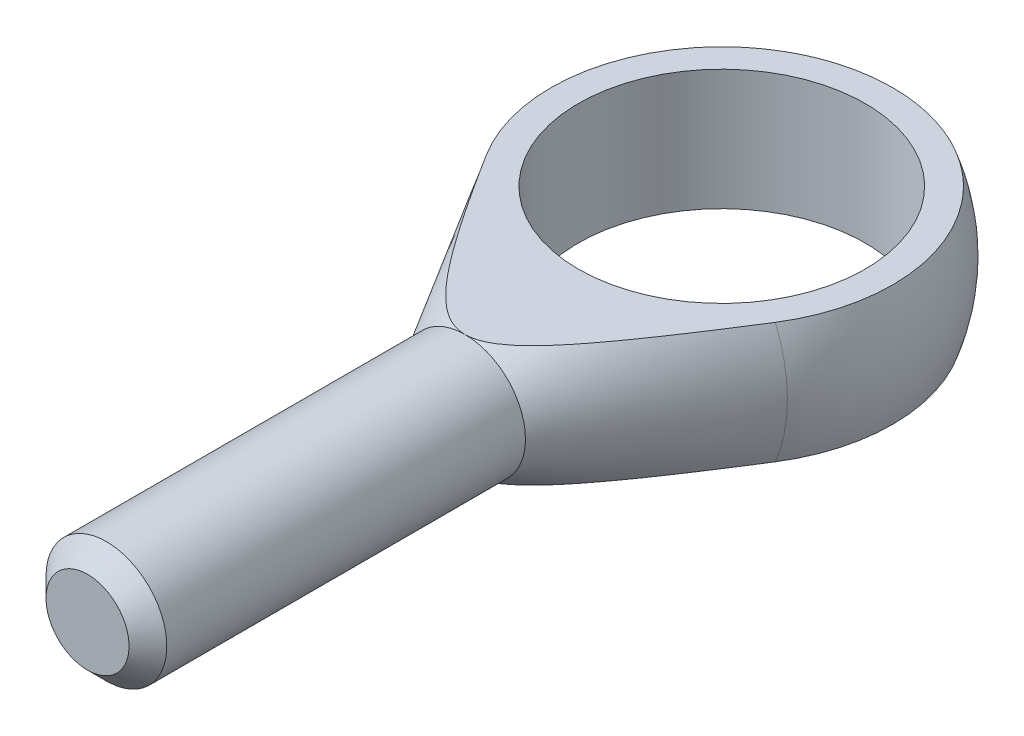
ISO-10303-21;
HEADER;
FILE_DESCRIPTION(('STEP AP214'),'2;1');
FILE_NAME('part.step','',(''),(''),'','','');
FILE_SCHEMA(('AUTOMOTIVE_DESIGN { 1 0 10303 214 1 1 1 1 }'));
ENDSEC;
DATA;
#1=APPLICATION_CONTEXT('core data for automotive mechanical design processes');
#2=APPLICATION_PROTOCOL_DEFINITION('international standard','automotive_design',2000,#1);
#3=PRODUCT_CONTEXT('',#1,'mechanical');
#4=PRODUCT('Part','Part','',(#3));
#5=PRODUCT_RELATED_PRODUCT_CATEGORY('part','',(#4));
#6=PRODUCT_DEFINITION_FORMATION('','',#4);
#7=PRODUCT_DEFINITION_CONTEXT('part definition',#1,'design');
#8=PRODUCT_DEFINITION('design','',#6,#7);
#9=PRODUCT_DEFINITION_SHAPE('','',#8);
#10=(LENGTH_UNIT() NAMED_UNIT(*) SI_UNIT(.MILLI.,.METRE.));
#11=(NAMED_UNIT(*) PLANE_ANGLE_UNIT() SI_UNIT($,.RADIAN.));
#12=(NAMED_UNIT(*) SI_UNIT($,.STERADIAN.) SOLID_ANGLE_UNIT());
#13=UNCERTAINTY_MEASURE_WITH_UNIT(LENGTH_MEASURE(1.E-05),#10,'distance_accuracy_value','');
#14=(GEOMETRIC_REPRESENTATION_CONTEXT(3) GLOBAL_UNCERTAINTY_ASSIGNED_CONTEXT((#13)) GLOBAL_UNIT_ASSIGNED_CONTEXT((#10,
#11,#12)) REPRESENTATION_CONTEXT('',''));
#15=CARTESIAN_POINT('',(0.,0.,0.));
#16=DIRECTION('',(0.,0.,1.));
#17=DIRECTION('',(1.,0.,0.));
#18=AXIS2_PLACEMENT_3D('',#15,#16,#17);
#19=CARTESIAN_POINT('',(0.,0.,17.));
#20=DIRECTION('',(0.,0.,-1.));
#21=DIRECTION('',(-1.,0.,0.));
#22=AXIS2_PLACEMENT_3D('',#19,#20,#21);
#23=CONICAL_SURFACE('',#22,4.,0.526424193542863);
#24=CARTESIAN_POINT('',(0.,0.,6.029338616585));
#25=DIRECTION('',(0.,0.,-1.));
#26=DIRECTION('',(-1.,0.,0.));
#27=AXIS2_PLACEMENT_3D('',#24,#25,#26);
#28=CIRCLE('',#27,10.3753108795138);
#29=CARTESIAN_POINT('',(-9.57324792568107,-4.,6.029338616585));
#30=VERTEX_POINT('',#29);
#31=CARTESIAN_POINT('',(-9.57324792568107,4.,6.029338616585));
#32=VERTEX_POINT('',#31);
#33=EDGE_CURVE('E97',#30,#32,#28,.T.);
#34=ORIENTED_EDGE('',*,*,#33,.F.);
#35=CARTESIAN_POINT('',(-23.68021346451,-4.,-17.4430516215624));
#36=CARTESIAN_POINT('',(-23.0406781249634,-4.,-16.3579595163777));
#37=CARTESIAN_POINT('',(-22.4006513109684,-4.,-15.2731564538364));
#38=CARTESIAN_POINT('',(-21.1192001492224,-4.,-13.1043404511158));
#39=CARTESIAN_POINT('',(-20.4777757677221,-4.,-12.0203275308802));
#40=CARTESIAN_POINT('',(-19.1918077546933,-4.,-9.85109931880753));
#41=CARTESIAN_POINT('',(-18.5472604085659,-4.,-8.76588622784728));
#42=CARTESIAN_POINT('',(-17.2557474204994,-4.,-6.59693197665542));
#43=CARTESIAN_POINT('',(-16.6087818318422,-4.,-5.51319078470197));
#44=CARTESIAN_POINT('',(-15.2381180504421,-4.,-3.2252707174007));
#45=CARTESIAN_POINT('',(-14.5140169432724,-4.,-2.02133279722277));
#46=CARTESIAN_POINT('',(-13.4230081813136,-4.,-0.218304662479718));
#47=CARTESIAN_POINT('',(-13.0585157842498,-4.,0.382246629551286));
#48=CARTESIAN_POINT('',(-12.3274619719917,-4.,1.5820864046069));
#49=CARTESIAN_POINT('',(-11.9609005643025,-4.,2.1813748922013));
#50=CARTESIAN_POINT('',(-11.225752732483,-4.,3.3772406077605));
#51=CARTESIAN_POINT('',(-10.8571710755747,-4.,3.97382076320369));
#52=CARTESIAN_POINT('',(-10.1164494710871,-4.,5.16476543771251));
#53=CARTESIAN_POINT('',(-9.74430954261025,-4.,5.75912996864884));
#54=CARTESIAN_POINT('',(-8.99519852993109,-4.,6.94471365991013));
#55=CARTESIAN_POINT('',(-8.61822805075949,-4.,7.5359332012715));
#56=CARTESIAN_POINT('',(-8.04751469995561,-4.,8.41935526828599));
#57=CARTESIAN_POINT('',(-7.85640332574946,-4.,8.71325737236326));
#58=CARTESIAN_POINT('',(-7.47202395147422,-4.,9.29964692811684));
#59=CARTESIAN_POINT('',(-7.27875596621592,-4.,9.59213438948865));
#60=CARTESIAN_POINT('',(-6.90149787482925,-4.,10.1574318418435));
#61=CARTESIAN_POINT('',(-6.71766648640972,-4.,10.4303476253203));
#62=CARTESIAN_POINT('',(-6.34707046776066,-4.,10.974211196266));
#63=CARTESIAN_POINT('',(-6.16030563631884,-4.,11.2451588468551));
#64=CARTESIAN_POINT('',(-5.78248017063813,-4.,11.7853427527789));
#65=CARTESIAN_POINT('',(-5.59140769528879,-4.,12.0545707493487));
#66=CARTESIAN_POINT('',(-5.20449408705651,-4.,12.5895114839058));
#67=CARTESIAN_POINT('',(-5.00865383663016,-4.,12.8552248585654));
#68=CARTESIAN_POINT('',(-4.61416192976892,-4.,13.3771762787073));
#69=CARTESIAN_POINT('',(-4.41562292328465,-4.,13.6334987964703));
#70=CARTESIAN_POINT('',(-4.11145183335168,-4.,14.013057997025));
#71=CARTESIAN_POINT('',(-4.00895707412254,-4.,14.1388082567965));
#72=CARTESIAN_POINT('',(-3.80147433445141,-4.,14.3882312215994));
#73=CARTESIAN_POINT('',(-3.69648647116791,-4.,14.5119040237924));
#74=CARTESIAN_POINT('',(-3.48404403989448,-4.,14.756083210462));
#75=CARTESIAN_POINT('',(-3.37660366345006,-4.,14.8766019057714));
#76=CARTESIAN_POINT('',(-3.15818426673768,-4.,15.1143781086933));
#77=CARTESIAN_POINT('',(-3.04720567984025,-4.,15.2316360124283));
#78=CARTESIAN_POINT('',(-2.82108656121575,-4.,15.4617788501846));
#79=CARTESIAN_POINT('',(-2.70595175627064,-4.,15.57466938836));
#80=CARTESIAN_POINT('',(-2.47044977350156,-4.,15.7948267899771));
#81=CARTESIAN_POINT('',(-2.35008485403534,-4.,15.9020960374027));
#82=CARTESIAN_POINT('',(-2.18265848257528,-4.,16.0422123607173));
#83=CARTESIAN_POINT('',(-2.13840404271817,-4.,16.0784249572243));
#84=CARTESIAN_POINT('',(-2.04901831158022,-4.,16.1497560258258));
#85=CARTESIAN_POINT('',(-2.00388697350546,-4.,16.1848744392698));
#86=CARTESIAN_POINT('',(-1.86705112743502,-4.,16.2884138594265));
#87=CARTESIAN_POINT('',(-1.77393510562682,-4.,16.3549934171646));
#88=CARTESIAN_POINT('',(-1.58380991750569,-4.,16.481596658911));
#89=CARTESIAN_POINT('',(-1.486816795161,-4.,16.5416441693873));
#90=CARTESIAN_POINT('',(-1.28829975791046,-4.,16.6536039546023));
#91=CARTESIAN_POINT('',(-1.18677862084971,-4.,16.705521131285));
#92=CARTESIAN_POINT('',(-0.950481069493551,-4.,16.8117433553234));
#93=CARTESIAN_POINT('',(-0.814188849784757,-4.,16.8628349185414));
#94=CARTESIAN_POINT('',(-0.605018164151721,-4.,16.9227176193301));
#95=CARTESIAN_POINT('',(-0.534497509992823,-4.,16.9398870876642));
#96=CARTESIAN_POINT('',(-0.392245939059182,-4.,16.9680508349935));
#97=CARTESIAN_POINT('',(-0.320515628916549,-4.,16.9790481196843));
#98=CARTESIAN_POINT('',(-0.175761448162927,-4.,16.9944886966712));
#99=CARTESIAN_POINT('',(-0.102731810622214,-4.,16.9988784153648));
#100=CARTESIAN_POINT('',(0.0434135143562021,-4.,17.000743157011));
#101=CARTESIAN_POINT('',(0.116529198500948,-4.,16.9982184364919));
#102=CARTESIAN_POINT('',(0.262206593732886,-4.,16.9863631064672));
#103=CARTESIAN_POINT('',(0.334768287017363,-4.,16.9770322791671));
#104=CARTESIAN_POINT('',(0.478792407170286,-4.,16.9519653521331));
#105=CARTESIAN_POINT('',(0.550254139899007,-4.,16.9362253670306));
#106=CARTESIAN_POINT('',(0.796407474959612,-4.,16.8712195222615));
#107=CARTESIAN_POINT('',(0.967237912152939,-4.,16.8068257012453));
#108=CARTESIAN_POINT('',(1.21414130969255,-4.,16.6912095614566));
#109=CARTESIAN_POINT('',(1.29502669147292,-4.,16.6494046341227));
#110=CARTESIAN_POINT('',(1.45389283218733,-4.,16.5605552923057));
#111=CARTESIAN_POINT('',(1.53187391373211,-4.,16.5135114620921));
#112=CARTESIAN_POINT('',(1.71101674385896,-4.,16.3985093146013));
#113=CARTESIAN_POINT('',(1.81108530936252,-4.,16.3288635270285));
#114=CARTESIAN_POINT('',(2.00691476619602,-4.,16.1837182894416));
#115=CARTESIAN_POINT('',(2.10267350781169,-4.,16.1082159682551));
#116=CARTESIAN_POINT('',(2.29059594696461,-4.,15.952561492306));
#117=CARTESIAN_POINT('',(2.38275297376889,-4.,15.8724013355222));
#118=CARTESIAN_POINT('',(2.56384425946285,-4.,15.708515017296));
#119=CARTESIAN_POINT('',(2.65277809242769,-4.,15.6247883877237));
#120=CARTESIAN_POINT('',(2.82849365118494,-4.,15.4538951845681));
#121=CARTESIAN_POINT('',(2.91525571868715,-4.,15.3667084772731));
#122=CARTESIAN_POINT('',(3.08637061350229,-4.,15.1900039289284));
#123=CARTESIAN_POINT('',(3.17072335966945,-4.,15.1004860095573));
#124=CARTESIAN_POINT('',(3.33724902667464,-4.,14.9196497840033));
#125=CARTESIAN_POINT('',(3.41942446217592,-4.,14.8283337879391));
#126=CARTESIAN_POINT('',(3.58197058439276,-4.,14.644119501175));
#127=CARTESIAN_POINT('',(3.66234133719875,-4.,14.5512212686389));
#128=CARTESIAN_POINT('',(3.92001293080157,-4.,14.2483245561668));
#129=CARTESIAN_POINT('',(4.09419322587146,-4.,14.035669781542));
#130=CARTESIAN_POINT('',(4.43672266563605,-4.,13.6057013427147));
#131=CARTESIAN_POINT('',(4.60507090453493,-4.,13.3883869632237));
#132=CARTESIAN_POINT('',(4.93733010616106,-4.,12.9502396896083));
#133=CARTESIAN_POINT('',(5.10123894584699,-4.,12.7294051895462));
#134=CARTESIAN_POINT('',(5.42550288109359,-4.,12.2851406201792));
#135=CARTESIAN_POINT('',(5.58585787375497,-4.,12.0617104760037));
#136=CARTESIAN_POINT('',(5.90401644827805,-4.,11.6124068832202));
#137=CARTESIAN_POINT('',(6.0618146043437,-4.,11.3865295993029));
#138=CARTESIAN_POINT('',(6.37507485726453,-4.,10.9331594873832));
#139=CARTESIAN_POINT('',(6.53053692440456,-4.,10.7056666388849));
#140=CARTESIAN_POINT('',(6.9939584236839,-4.,10.0213778185043));
#141=CARTESIAN_POINT('',(7.29904685599399,-4.,9.56263809275353));
#142=CARTESIAN_POINT('',(7.90299353295308,-4.,8.64290252342948));
#143=CARTESIAN_POINT('',(8.20186664975931,-4.,8.18191640216505));
#144=CARTESIAN_POINT('',(8.79567344530436,-4.,7.25737224010798));
#145=CARTESIAN_POINT('',(9.09060685250872,-4.,6.79381402512507));
#146=CARTESIAN_POINT('',(9.67715604172119,-4.,5.86530772646236));
#147=CARTESIAN_POINT('',(9.96877506791858,-4.,5.40036168914456));
#148=CARTESIAN_POINT('',(10.5496747021537,-4.,4.46902636055594));
#149=CARTESIAN_POINT('',(10.8389553606031,-4.,4.00263710070013));
#150=CARTESIAN_POINT('',(11.6631749352386,-4.,2.66795692752376));
#151=CARTESIAN_POINT('',(12.1958649463402,-4.,1.79827774629911));
#152=CARTESIAN_POINT('',(13.2569729060647,-4.,0.0563089783539163));
#153=CARTESIAN_POINT('',(13.7853908062707,-4.,-0.815980637798192));
#154=CARTESIAN_POINT('',(14.8394015739592,-4.,-2.56279013256259));
#155=CARTESIAN_POINT('',(15.3649930890528,-4.,-3.43731082675435));
#156=CARTESIAN_POINT('',(16.4139213064292,-4.,-5.18770360852838));
#157=CARTESIAN_POINT('',(16.9372580066328,-4.,-6.06357569735578));
#158=CARTESIAN_POINT('',(17.9807782405503,-4.,-7.81392391127846));
#159=CARTESIAN_POINT('',(18.500966489746,-4.,-8.68839722608845));
#160=CARTESIAN_POINT('',(19.5400188623069,-4.,-10.43813161105));
#161=CARTESIAN_POINT('',(20.0588829838085,-4.,-11.3133926823078));
#162=CARTESIAN_POINT('',(21.0953074021159,-4.,-13.0641031634049));
#163=CARTESIAN_POINT('',(21.6128682158915,-4.,-13.9395522672721));
#164=CARTESIAN_POINT('',(22.6471341695434,-4.,-15.6909531847423));
#165=CARTESIAN_POINT('',(23.1638393113291,-4.,-16.5669049972177));
#166=CARTESIAN_POINT('',(23.68021346451,-4.,-17.4430516215624));
#167=B_SPLINE_CURVE_WITH_KNOTS('',3,(#35,#36,#37,#38,#39,#40,#41,#42,#43,#44,#45,#46,#47,#48,
#49,#50,#51,#52,#53,#54,#55,#56,#57,#58,#59,#60,#61,#62,#63,#64,#65,#66,#67,#68,#69,#70,#71,#72,
#73,#74,#75,#76,#77,#78,#79,#80,#81,#82,#83,#84,#85,#86,#87,#88,#89,#90,#91,#92,#93,#94,#95,#96,
#97,#98,#99,#100,#101,#102,#103,#104,#105,#106,#107,#108,#109,#110,#111,#112,#113,#114,#115,
#116,#117,#118,#119,#120,#121,#122,#123,#124,#125,#126,#127,#128,#129,#130,#131,#132,#133,#134,
#135,#136,#137,#138,#139,#140,#141,#142,#143,#144,#145,#146,#147,#148,#149,#150,#151,#152,#153,
#154,#155,#156,#157,#158,#159,#160,#161,#162,#163,#164,#165,#166),.UNSPECIFIED.,.F.,.F.,(4,2,2,
2,2,2,2,2,2,2,2,2,2,2,2,2,2,2,2,2,2,2,2,2,2,2,2,2,2,2,2,2,2,2,2,2,2,2,2,2,2,2,2,2,2,2,2,2,2,2,2,
2,2,2,2,2,2,2,2,2,2,2,2,2,2,4),(0.,3.77860792695099,7.55730813663397,11.3438816650846,
15.1303722488871,19.3451046695319,21.4526235883756,23.56013486747,25.6638939667756,
27.7676417784807,29.8711286206105,30.9228429301846,31.9745500214167,32.9616992591333,
33.948916506206,34.9392950818656,35.9294917236842,36.9020065641081,37.3886690788173,
37.8753087688672,38.3596220558518,38.8438762488951,39.3274869178397,39.8108907999744,
39.9824229229266,40.1539642246215,40.4971657827121,40.8390702327932,41.1807677414056,
41.615696496413,41.8332108133973,42.0506191143607,42.2697808243834,42.4889344035353,
42.7080949958797,42.92738864634,43.4714627137097,43.7445145207165,44.0175359060118,
44.3830173418646,44.7486791018443,45.1149887804409,45.4813466893676,45.8502944847838,
46.2192546917163,46.5877683493291,46.9562684892851,47.7807559582136,48.6053709120772,
49.4303734947903,50.255399933781,51.0819937230636,51.9085980177674,53.561317423816,
55.2094750040469,56.857745599243,58.5042328859561,60.1506845817792,63.2102229923976,
66.2697960289792,69.330721852847,72.3916504986268,75.444138906732,78.4966316084729,
81.547618299729,84.5985981734221),.UNSPECIFIED.);
#168=CARTESIAN_POINT('',(0.,-4.,17.));
#169=VERTEX_POINT('',#168);
#170=EDGE_CURVE('E93',#30,#169,#167,.T.);
#171=ORIENTED_EDGE('',*,*,#170,.T.);
#172=CARTESIAN_POINT('',(0.,0.,17.));
#173=DIRECTION('',(0.,0.,-1.));
#174=DIRECTION('',(-1.,0.,0.));
#175=AXIS2_PLACEMENT_3D('',#172,#173,#174);
#176=CIRCLE('',#175,4.);
#177=CARTESIAN_POINT('',(0.,4.,17.));
#178=VERTEX_POINT('',#177);
#179=EDGE_CURVE('E92',#169,#178,#176,.T.);
#180=ORIENTED_EDGE('',*,*,#179,.T.);
#181=CARTESIAN_POINT('',(23.68021346451,4.,-17.4430516215624));
#182=CARTESIAN_POINT('',(23.0406781249634,4.,-16.3579595163777));
#183=CARTESIAN_POINT('',(22.4006513109684,4.,-15.2731564538364));
#184=CARTESIAN_POINT('',(21.1192001492224,4.,-13.1043404511158));
#185=CARTESIAN_POINT('',(20.4777757677221,4.,-12.0203275308802));
#186=CARTESIAN_POINT('',(19.1918077546933,4.,-9.85109931880753));
#187=CARTESIAN_POINT('',(18.5472604085659,4.,-8.76588622784728));
#188=CARTESIAN_POINT('',(17.2557474204994,4.,-6.59693197665542));
#189=CARTESIAN_POINT('',(16.6087818318422,4.,-5.51319078470197));
#190=CARTESIAN_POINT('',(15.2381180504421,4.,-3.2252707174007));
#191=CARTESIAN_POINT('',(14.5140169432724,4.,-2.02133279722277));
#192=CARTESIAN_POINT('',(13.4230081813136,4.,-0.218304662479718));
#193=CARTESIAN_POINT('',(13.0585157842498,4.,0.382246629551286));
#194=CARTESIAN_POINT('',(12.3274619719917,4.,1.5820864046069));
#195=CARTESIAN_POINT('',(11.9609005643025,4.,2.1813748922013));
#196=CARTESIAN_POINT('',(11.225752732483,4.,3.3772406077605));
#197=CARTESIAN_POINT('',(10.8571710755747,4.,3.97382076320369));
#198=CARTESIAN_POINT('',(10.1164494710871,4.,5.16476543771251));
#199=CARTESIAN_POINT('',(9.74430954261025,4.,5.75912996864884));
#200=CARTESIAN_POINT('',(8.99519852993109,4.,6.94471365991013));
#201=CARTESIAN_POINT('',(8.61822805075949,4.,7.5359332012715));
#202=CARTESIAN_POINT('',(8.04751469995561,4.,8.41935526828599));
#203=CARTESIAN_POINT('',(7.85640332574946,4.,8.71325737236326));
#204=CARTESIAN_POINT('',(7.47202395147422,4.,9.29964692811684));
#205=CARTESIAN_POINT('',(7.27875596621592,4.,9.59213438948865));
#206=CARTESIAN_POINT('',(6.90149787482925,4.,10.1574318418435));
#207=CARTESIAN_POINT('',(6.71766648640972,4.,10.4303476253203));
#208=CARTESIAN_POINT('',(6.34707046776066,4.,10.974211196266));
#209=CARTESIAN_POINT('',(6.16030563631884,4.,11.2451588468551));
#210=CARTESIAN_POINT('',(5.78248017063813,4.,11.7853427527789));
#211=CARTESIAN_POINT('',(5.59140769528879,4.,12.0545707493487));
#212=CARTESIAN_POINT('',(5.20449408705651,4.,12.5895114839058));
#213=CARTESIAN_POINT('',(5.00865383663016,4.,12.8552248585654));
#214=CARTESIAN_POINT('',(4.61416192976892,4.,13.3771762787073));
#215=CARTESIAN_POINT('',(4.41562292328465,4.,13.6334987964703));
#216=CARTESIAN_POINT('',(4.11145183335168,4.,14.013057997025));
#217=CARTESIAN_POINT('',(4.00895707412254,4.,14.1388082567965));
#218=CARTESIAN_POINT('',(3.80147433445141,4.,14.3882312215994));
#219=CARTESIAN_POINT('',(3.69648647116791,4.,14.5119040237924));
#220=CARTESIAN_POINT('',(3.48404403989448,4.,14.756083210462));
#221=CARTESIAN_POINT('',(3.37660366345006,4.,14.8766019057714));
#222=CARTESIAN_POINT('',(3.15818426673768,4.,15.1143781086933));
#223=CARTESIAN_POINT('',(3.04720567984025,4.,15.2316360124283));
#224=CARTESIAN_POINT('',(2.82108656121575,4.,15.4617788501846));
#225=CARTESIAN_POINT('',(2.70595175627064,4.,15.57466938836));
#226=CARTESIAN_POINT('',(2.47044977350156,4.,15.7948267899771));
#227=CARTESIAN_POINT('',(2.35008485403534,4.,15.9020960374027));
#228=CARTESIAN_POINT('',(2.18265848257528,4.,16.0422123607173));
#229=CARTESIAN_POINT('',(2.13840404271817,4.,16.0784249572243));
#230=CARTESIAN_POINT('',(2.04901831158022,4.,16.1497560258258));
#231=CARTESIAN_POINT('',(2.00388697350546,4.,16.1848744392698));
#232=CARTESIAN_POINT('',(1.86705112743502,4.,16.2884138594265));
#233=CARTESIAN_POINT('',(1.77393510562682,4.,16.3549934171646));
#234=CARTESIAN_POINT('',(1.58380991750569,4.,16.481596658911));
#235=CARTESIAN_POINT('',(1.486816795161,4.,16.5416441693873));
#236=CARTESIAN_POINT('',(1.28829975791046,4.,16.6536039546023));
#237=CARTESIAN_POINT('',(1.18677862084971,4.,16.705521131285));
#238=CARTESIAN_POINT('',(0.950481069493551,4.,16.8117433553234));
#239=CARTESIAN_POINT('',(0.814188849784757,4.,16.8628349185414));
#240=CARTESIAN_POINT('',(0.605018164151721,4.,16.9227176193301));
#241=CARTESIAN_POINT('',(0.534497509992823,4.,16.9398870876642));
#242=CARTESIAN_POINT('',(0.392245939059182,4.,16.9680508349935));
#243=CARTESIAN_POINT('',(0.320515628916549,4.,16.9790481196843));
#244=CARTESIAN_POINT('',(0.175761448162927,4.,16.9944886966712));
#245=CARTESIAN_POINT('',(0.102731810622214,4.,16.9988784153648));
#246=CARTESIAN_POINT('',(-0.0434135143562021,4.,17.000743157011));
#247=CARTESIAN_POINT('',(-0.116529198500948,4.,16.9982184364919));
#248=CARTESIAN_POINT('',(-0.262206593732886,4.,16.9863631064672));
#249=CARTESIAN_POINT('',(-0.334768287017363,4.,16.9770322791671));
#250=CARTESIAN_POINT('',(-0.478792407170286,4.,16.9519653521331));
#251=CARTESIAN_POINT('',(-0.550254139899007,4.,16.9362253670306));
#252=CARTESIAN_POINT('',(-0.796407474959612,4.,16.8712195222615));
#253=CARTESIAN_POINT('',(-0.967237912152939,4.,16.8068257012453));
#254=CARTESIAN_POINT('',(-1.21414130969255,4.,16.6912095614566));
#255=CARTESIAN_POINT('',(-1.29502669147292,4.,16.6494046341227));
#256=CARTESIAN_POINT('',(-1.45389283218733,4.,16.5605552923057));
#257=CARTESIAN_POINT('',(-1.53187391373211,4.,16.5135114620921));
#258=CARTESIAN_POINT('',(-1.71101674385896,4.,16.3985093146013));
#259=CARTESIAN_POINT('',(-1.81108530936252,4.,16.3288635270285));
#260=CARTESIAN_POINT('',(-2.00691476619602,4.,16.1837182894416));
#261=CARTESIAN_POINT('',(-2.10267350781169,4.,16.1082159682551));
#262=CARTESIAN_POINT('',(-2.29059594696461,4.,15.952561492306));
#263=CARTESIAN_POINT('',(-2.38275297376889,4.,15.8724013355222));
#264=CARTESIAN_POINT('',(-2.56384425946285,4.,15.708515017296));
#265=CARTESIAN_POINT('',(-2.65277809242769,4.,15.6247883877237));
#266=CARTESIAN_POINT('',(-2.82849365118494,4.,15.4538951845681));
#267=CARTESIAN_POINT('',(-2.91525571868715,4.,15.3667084772731));
#268=CARTESIAN_POINT('',(-3.08637061350229,4.,15.1900039289284));
#269=CARTESIAN_POINT('',(-3.17072335966945,4.,15.1004860095573));
#270=CARTESIAN_POINT('',(-3.33724902667464,4.,14.9196497840033));
#271=CARTESIAN_POINT('',(-3.41942446217592,4.,14.8283337879391));
#272=CARTESIAN_POINT('',(-3.58197058439276,4.,14.644119501175));
#273=CARTESIAN_POINT('',(-3.66234133719875,4.,14.5512212686389));
#274=CARTESIAN_POINT('',(-3.92001293080157,4.,14.2483245561668));
#275=CARTESIAN_POINT('',(-4.09419322587146,4.,14.035669781542));
#276=CARTESIAN_POINT('',(-4.43672266563605,4.,13.6057013427147));
#277=CARTESIAN_POINT('',(-4.60507090453493,4.,13.3883869632237));
#278=CARTESIAN_POINT('',(-4.93733010616106,4.,12.9502396896083));
#279=CARTESIAN_POINT('',(-5.10123894584699,4.,12.7294051895462));
#280=CARTESIAN_POINT('',(-5.42550288109359,4.,12.2851406201792));
#281=CARTESIAN_POINT('',(-5.58585787375497,4.,12.0617104760037));
#282=CARTESIAN_POINT('',(-5.90401644827805,4.,11.6124068832202));
#283=CARTESIAN_POINT('',(-6.0618146043437,4.,11.3865295993029));
#284=CARTESIAN_POINT('',(-6.37507485726453,4.,10.9331594873832));
#285=CARTESIAN_POINT('',(-6.53053692440456,4.,10.7056666388849));
#286=CARTESIAN_POINT('',(-6.9939584236839,4.,10.0213778185043));
#287=CARTESIAN_POINT('',(-7.29904685599399,4.,9.56263809275353));
#288=CARTESIAN_POINT('',(-7.90299353295308,4.,8.64290252342948));
#289=CARTESIAN_POINT('',(-8.20186664975931,4.,8.18191640216505));
#290=CARTESIAN_POINT('',(-8.79567344530436,4.,7.25737224010798));
#291=CARTESIAN_POINT('',(-9.09060685250872,4.,6.79381402512507));
#292=CARTESIAN_POINT('',(-9.67715604172119,4.,5.86530772646236));
#293=CARTESIAN_POINT('',(-9.96877506791858,4.,5.40036168914456));
#294=CARTESIAN_POINT('',(-10.5496747021537,4.,4.46902636055594));
#295=CARTESIAN_POINT('',(-10.8389553606031,4.,4.00263710070013));
#296=CARTESIAN_POINT('',(-11.6631749352386,4.,2.66795692752376));
#297=CARTESIAN_POINT('',(-12.1958649463402,4.,1.79827774629911));
#298=CARTESIAN_POINT('',(-13.2569729060647,4.,0.0563089783539163));
#299=CARTESIAN_POINT('',(-13.7853908062707,4.,-0.815980637798192));
#300=CARTESIAN_POINT('',(-14.8394015739592,4.,-2.56279013256259));
#301=CARTESIAN_POINT('',(-15.3649930890528,4.,-3.43731082675435));
#302=CARTESIAN_POINT('',(-16.4139213064292,4.,-5.18770360852838));
#303=CARTESIAN_POINT('',(-16.9372580066328,4.,-6.06357569735578));
#304=CARTESIAN_POINT('',(-17.9807782405503,4.,-7.81392391127846));
#305=CARTESIAN_POINT('',(-18.500966489746,4.,-8.68839722608845));
#306=CARTESIAN_POINT('',(-19.5400188623069,4.,-10.43813161105));
#307=CARTESIAN_POINT('',(-20.0588829838085,4.,-11.3133926823078));
#308=CARTESIAN_POINT('',(-21.0953074021159,4.,-13.0641031634049));
#309=CARTESIAN_POINT('',(-21.6128682158915,4.,-13.9395522672721));
#310=CARTESIAN_POINT('',(-22.6471341695434,4.,-15.6909531847423));
#311=CARTESIAN_POINT('',(-23.1638393113291,4.,-16.5669049972177));
#312=CARTESIAN_POINT('',(-23.68021346451,4.,-17.4430516215624));
#313=B_SPLINE_CURVE_WITH_KNOTS('',3,(#181,#182,#183,#184,#185,#186,#187,#188,#189,#190,#191,
#192,#193,#194,#195,#196,#197,#198,#199,#200,#201,#202,#203,#204,#205,#206,#207,#208,#209,#210,
#211,#212,#213,#214,#215,#216,#217,#218,#219,#220,#221,#222,#223,#224,#225,#226,#227,#228,#229,
#230,#231,#232,#233,#234,#235,#236,#237,#238,#239,#240,#241,#242,#243,#244,#245,#246,#247,#248,
#249,#250,#251,#252,#253,#254,#255,#256,#257,#258,#259,#260,#261,#262,#263,#264,#265,#266,#267,
#268,#269,#270,#271,#272,#273,#274,#275,#276,#277,#278,#279,#280,#281,#282,#283,#284,#285,#286,
#287,#288,#289,#290,#291,#292,#293,#294,#295,#296,#297,#298,#299,#300,#301,#302,#303,#304,#305,
#306,#307,#308,#309,#310,#311,#312),.UNSPECIFIED.,.F.,.F.,(4,2,2,2,2,2,2,2,2,2,2,2,2,2,2,2,2,2,
2,2,2,2,2,2,2,2,2,2,2,2,2,2,2,2,2,2,2,2,2,2,2,2,2,2,2,2,2,2,2,2,2,2,2,2,2,2,2,2,2,2,2,2,2,2,2,
4),(0.,3.77860792695099,7.55730813663397,11.3438816650846,15.1303722488871,19.3451046695319,
21.4526235883756,23.56013486747,25.6638939667756,27.7676417784807,29.8711286206105,
30.9228429301846,31.9745500214167,32.9616992591333,33.948916506206,34.9392950818656,
35.9294917236842,36.9020065641081,37.3886690788173,37.8753087688672,38.3596220558518,
38.8438762488951,39.3274869178397,39.8108907999744,39.9824229229266,40.1539642246215,
40.4971657827121,40.8390702327932,41.1807677414056,41.615696496413,41.8332108133973,
42.0506191143607,42.2697808243834,42.4889344035353,42.7080949958797,42.92738864634,
43.4714627137097,43.7445145207165,44.0175359060118,44.3830173418646,44.7486791018443,
45.1149887804409,45.4813466893676,45.8502944847838,46.2192546917163,46.5877683493291,
46.9562684892851,47.7807559582136,48.6053709120772,49.4303734947903,50.255399933781,
51.0819937230636,51.9085980177674,53.561317423816,55.2094750040469,56.857745599243,
58.5042328859561,60.1506845817792,63.2102229923976,66.2697960289792,69.330721852847,
72.3916504986268,75.444138906732,78.4966316084729,81.547618299729,84.5985981734221),.UNSPECIFIED.);
#314=EDGE_CURVE('E72',#178,#32,#313,.T.);
#315=ORIENTED_EDGE('',*,*,#314,.T.);
#316=EDGE_LOOP('',(#34,#171,#180,#315));
#317=FACE_BOUND('',#316,.T.);
#318=ADVANCED_FACE('F37',(#317),#23,.T.);
#319=EDGE_CURVE('E87',#178,#169,#176,.T.);
#320=ORIENTED_EDGE('',*,*,#319,.T.);
#321=CARTESIAN_POINT('',(9.57324792568107,-4.,6.029338616585));
#322=VERTEX_POINT('',#321);
#323=EDGE_CURVE('E89',#169,#322,#167,.T.);
#324=ORIENTED_EDGE('',*,*,#323,.T.);
#325=CARTESIAN_POINT('',(9.57324792568107,4.,6.029338616585));
#326=VERTEX_POINT('',#325);
#327=EDGE_CURVE('E88',#326,#322,#28,.T.);
#328=ORIENTED_EDGE('',*,*,#327,.F.);
#329=EDGE_CURVE('E75',#326,#178,#313,.T.);
#330=ORIENTED_EDGE('',*,*,#329,.T.);
#331=EDGE_LOOP('',(#320,#324,#328,#330));
#332=FACE_BOUND('',#331,.T.);
#333=ADVANCED_FACE('F85',(#332),#23,.T.);
#334=CARTESIAN_POINT('',(0.,0.,0.));
#335=DIRECTION('',(0.,0.,-1.));
#336=DIRECTION('',(1.,0.,0.));
#337=AXIS2_PLACEMENT_3D('',#334,#335,#336);
#338=SPHERICAL_SURFACE('',#337,12.);
#339=CARTESIAN_POINT('',(0.,-4.,0.));
#340=DIRECTION('',(0.,1.,0.));
#341=DIRECTION('',(0.,0.,1.));
#342=AXIS2_PLACEMENT_3D('',#339,#340,#341);
#343=CIRCLE('',#342,11.3137084989848);
#344=EDGE_CURVE('E53',#322,#30,#343,.T.);
#345=ORIENTED_EDGE('',*,*,#344,.T.);
#346=ORIENTED_EDGE('',*,*,#33,.T.);
#347=CARTESIAN_POINT('',(0.,4.,0.));
#348=DIRECTION('',(0.,-1.,0.));
#349=DIRECTION('',(0.,0.,-1.));
#350=AXIS2_PLACEMENT_3D('',#347,#348,#349);
#351=CIRCLE('',#350,11.3137084989848);
#352=EDGE_CURVE('E77',#32,#326,#351,.T.);
#353=ORIENTED_EDGE('',*,*,#352,.T.);
#354=ORIENTED_EDGE('',*,*,#327,.T.);
#355=EDGE_LOOP('',(#345,#346,#353,#354));
#356=FACE_BOUND('',#355,.T.);
#357=ADVANCED_FACE('F125',(#356),#338,.T.);
#358=CARTESIAN_POINT('',(0.,0.,42.));
#359=DIRECTION('',(0.,0.,-1.));
#360=DIRECTION('',(-1.,0.,0.));
#361=AXIS2_PLACEMENT_3D('',#358,#359,#360);
#362=PLANE('',#361);
#363=CARTESIAN_POINT('',(0.,0.,42.));
#364=DIRECTION('',(0.,0.,-1.));
#365=DIRECTION('',(-1.,0.,0.));
#366=AXIS2_PLACEMENT_3D('',#363,#364,#365);
#367=CIRCLE('',#366,2.75000000000002);
#368=CARTESIAN_POINT('',(-2.75000000000002,0.,42.));
#369=VERTEX_POINT('',#368);
#370=EDGE_CURVE('E11',#369,#369,#367,.F.);
#371=ORIENTED_EDGE('',*,*,#370,.T.);
#372=EDGE_LOOP('',(#371));
#373=FACE_BOUND('',#372,.T.);
#374=ADVANCED_FACE('F143',(#373),#362,.F.);
#375=CARTESIAN_POINT('',(0.,0.,-26.0435164980697));
#376=DIRECTION('',(0.,0.,-1.));
#377=DIRECTION('',(-1.,0.,0.));
#378=AXIS2_PLACEMENT_3D('',#375,#376,#377);
#379=CYLINDRICAL_SURFACE('',#378,4.);
#380=CARTESIAN_POINT('',(0.,0.,40.75));
#381=DIRECTION('',(0.,0.,-1.));
#382=DIRECTION('',(-1.,0.,0.));
#383=AXIS2_PLACEMENT_3D('',#380,#381,#382);
#384=CIRCLE('',#383,4.);
#385=CARTESIAN_POINT('',(-4.,0.,40.75));
#386=VERTEX_POINT('',#385);
#387=EDGE_CURVE('E46',#386,#386,#384,.T.);
#388=ORIENTED_EDGE('',*,*,#387,.T.);
#389=EDGE_LOOP('',(#388));
#390=FACE_BOUND('',#389,.T.);
#391=ORIENTED_EDGE('',*,*,#319,.F.);
#392=ORIENTED_EDGE('',*,*,#179,.F.);
#393=EDGE_LOOP('',(#391,#392));
#394=FACE_BOUND('',#393,.T.);
#395=ADVANCED_FACE('F96',(#390,#394),#379,.T.);
#396=CARTESIAN_POINT('',(-12.,4.,17.));
#397=DIRECTION('',(0.,-1.,0.));
#398=DIRECTION('',(0.,0.,-1.));
#399=AXIS2_PLACEMENT_3D('',#396,#397,#398);
#400=PLANE('',#399);
#401=CARTESIAN_POINT('',(0.,4.00000000000001,0.));
#402=DIRECTION('',(0.,1.,0.));
#403=DIRECTION('',(0.,0.,1.));
#404=AXIS2_PLACEMENT_3D('',#401,#402,#403);
#405=CIRCLE('',#404,9.5);
#406=CARTESIAN_POINT('',(0.,4.00000000000001,9.5));
#407=VERTEX_POINT('',#406);
#408=EDGE_CURVE('E201',#407,#407,#405,.T.);
#409=ORIENTED_EDGE('',*,*,#408,.F.);
#410=EDGE_LOOP('',(#409));
#411=FACE_BOUND('',#410,.T.);
#412=ORIENTED_EDGE('',*,*,#329,.F.);
#413=ORIENTED_EDGE('',*,*,#352,.F.);
#414=ORIENTED_EDGE('',*,*,#314,.F.);
#415=EDGE_LOOP('',(#412,#413,#414));
#416=FACE_BOUND('',#415,.T.);
#417=ADVANCED_FACE('F74',(#411,#416),#400,.F.);
#418=CARTESIAN_POINT('',(-12.,-4.,17.));
#419=DIRECTION('',(0.,1.,0.));
#420=DIRECTION('',(0.,0.,1.));
#421=AXIS2_PLACEMENT_3D('',#418,#419,#420);
#422=PLANE('',#421);
#423=CARTESIAN_POINT('',(0.,-4.00000000000001,0.));
#424=DIRECTION('',(0.,1.,0.));
#425=DIRECTION('',(0.,0.,1.));
#426=AXIS2_PLACEMENT_3D('',#423,#424,#425);
#427=CIRCLE('',#426,9.5);
#428=CARTESIAN_POINT('',(0.,-4.00000000000001,9.5));
#429=VERTEX_POINT('',#428);
#430=EDGE_CURVE('E81',#429,#429,#427,.T.);
#431=ORIENTED_EDGE('',*,*,#430,.T.);
#432=EDGE_LOOP('',(#431));
#433=FACE_BOUND('',#432,.T.);
#434=ORIENTED_EDGE('',*,*,#170,.F.);
#435=ORIENTED_EDGE('',*,*,#344,.F.);
#436=ORIENTED_EDGE('',*,*,#323,.F.);
#437=EDGE_LOOP('',(#434,#435,#436));
#438=FACE_BOUND('',#437,.T.);
#439=ADVANCED_FACE('F117',(#433,#438),#422,.F.);
#440=CARTESIAN_POINT('',(0.,-4.00000000000001,0.));
#441=DIRECTION('',(0.,1.,0.));
#442=DIRECTION('',(0.,0.,1.));
#443=AXIS2_PLACEMENT_3D('',#440,#441,#442);
#444=CYLINDRICAL_SURFACE('',#443,9.5);
#445=ORIENTED_EDGE('',*,*,#430,.F.);
#446=EDGE_LOOP('',(#445));
#447=FACE_BOUND('',#446,.T.);
#448=ORIENTED_EDGE('',*,*,#408,.T.);
#449=EDGE_LOOP('',(#448));
#450=FACE_BOUND('',#449,.T.);
#451=ADVANCED_FACE('F112',(#447,#450),#444,.F.);
#452=CARTESIAN_POINT('',(0.,0.,40.75));
#453=DIRECTION('',(0.,0.,-1.));
#454=DIRECTION('',(-1.,0.,0.));
#455=AXIS2_PLACEMENT_3D('',#452,#453,#454);
#456=CONICAL_SURFACE('',#455,4.,0.785398163397446);
#457=ORIENTED_EDGE('',*,*,#370,.F.);
#458=EDGE_LOOP('',(#457));
#459=FACE_BOUND('',#458,.T.);
#460=ORIENTED_EDGE('',*,*,#387,.F.);
#461=EDGE_LOOP('',(#460));
#462=FACE_BOUND('',#461,.T.);
#463=ADVANCED_FACE('F40',(#459,#462),#456,.T.);
#464=CLOSED_SHELL('',(#318,#333,#357,#374,#395,#417,#439,#451,#463));
#465=MANIFOLD_SOLID_BREP('B2',#464);
#466=ADVANCED_BREP_SHAPE_REPRESENTATION('',(#18,#465),#14);
#467=SHAPE_DEFINITION_REPRESENTATION(#9,#466);
ENDSEC;
END-ISO-10303-21;
